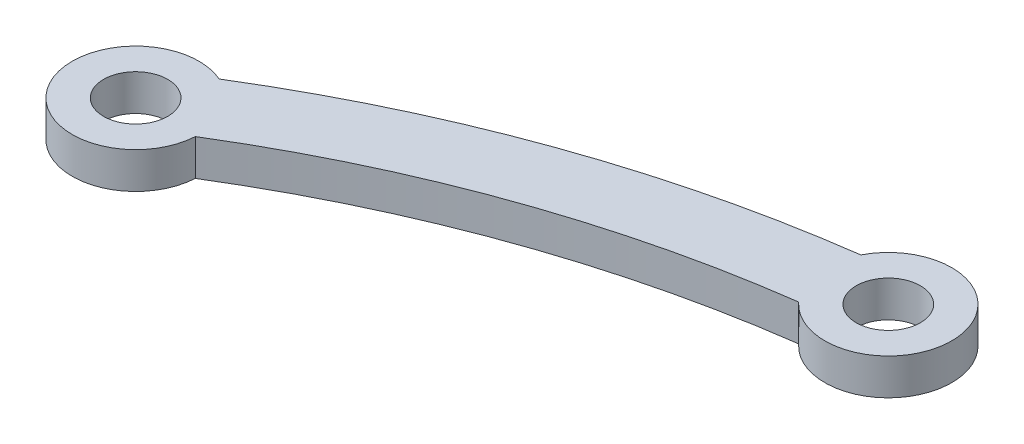
ISO-10303-21;
HEADER;
FILE_DESCRIPTION(('STEP AP214'),'2;1');
FILE_NAME('part.step','',(''),(''),'','','');
FILE_SCHEMA(('AUTOMOTIVE_DESIGN { 1 0 10303 214 1 1 1 1 }'));
ENDSEC;
DATA;
#1=APPLICATION_CONTEXT('core data for automotive mechanical design processes');
#2=APPLICATION_PROTOCOL_DEFINITION('international standard','automotive_design',2000,#1);
#3=PRODUCT_CONTEXT('',#1,'mechanical');
#4=PRODUCT('Part','Part','',(#3));
#5=PRODUCT_RELATED_PRODUCT_CATEGORY('part','',(#4));
#6=PRODUCT_DEFINITION_FORMATION('','',#4);
#7=PRODUCT_DEFINITION_CONTEXT('part definition',#1,'design');
#8=PRODUCT_DEFINITION('design','',#6,#7);
#9=PRODUCT_DEFINITION_SHAPE('','',#8);
#10=(LENGTH_UNIT() NAMED_UNIT(*) SI_UNIT(.MILLI.,.METRE.));
#11=(NAMED_UNIT(*) PLANE_ANGLE_UNIT() SI_UNIT($,.RADIAN.));
#12=(NAMED_UNIT(*) SI_UNIT($,.STERADIAN.) SOLID_ANGLE_UNIT());
#13=UNCERTAINTY_MEASURE_WITH_UNIT(LENGTH_MEASURE(1.E-05),#10,'distance_accuracy_value','');
#14=(GEOMETRIC_REPRESENTATION_CONTEXT(3) GLOBAL_UNCERTAINTY_ASSIGNED_CONTEXT((#13)) GLOBAL_UNIT_ASSIGNED_CONTEXT((#10,
#11,#12)) REPRESENTATION_CONTEXT('',''));
#15=CARTESIAN_POINT('',(0.,0.,0.));
#16=DIRECTION('',(0.,0.,1.));
#17=DIRECTION('',(1.,0.,0.));
#18=AXIS2_PLACEMENT_3D('',#15,#16,#17);
#19=CARTESIAN_POINT('',(-47.2140331764881,2.54,-12.7));
#20=DIRECTION('',(0.,-1.,0.));
#21=DIRECTION('',(0.,0.,-1.));
#22=AXIS2_PLACEMENT_3D('',#19,#20,#21);
#23=CYLINDRICAL_SURFACE('',#22,4.445);
#24=CARTESIAN_POINT('',(-47.2140331764881,0.,-12.7));
#25=DIRECTION('',(0.,1.,0.));
#26=DIRECTION('',(0.,0.,1.));
#27=AXIS2_PLACEMENT_3D('',#24,#25,#26);
#28=CIRCLE('',#27,4.445);
#29=CARTESIAN_POINT('',(-45.4322346630016,0.,-16.7722498765839));
#30=VERTEX_POINT('',#29);
#31=CARTESIAN_POINT('',(-42.7765447896225,0.,-12.4416943352668));
#32=VERTEX_POINT('',#31);
#33=EDGE_CURVE('E105',#30,#32,#28,.T.);
#34=ORIENTED_EDGE('',*,*,#33,.T.);
#35=DIRECTION('',(0.,-1.,0.));
#36=VECTOR('',#35,1.);
#37=CARTESIAN_POINT('',(-42.7765447896225,2.54,-12.4416943352668));
#38=LINE('',#37,#36);
#39=CARTESIAN_POINT('',(-42.7765447896225,2.54,-12.4416943352668));
#40=VERTEX_POINT('',#39);
#41=EDGE_CURVE('E11',#40,#32,#38,.T.);
#42=ORIENTED_EDGE('',*,*,#41,.F.);
#43=CARTESIAN_POINT('',(-47.2140331764881,2.54,-12.7));
#44=DIRECTION('',(0.,1.,0.));
#45=DIRECTION('',(0.,0.,1.));
#46=AXIS2_PLACEMENT_3D('',#43,#44,#45);
#47=CIRCLE('',#46,4.445);
#48=CARTESIAN_POINT('',(-45.4322346630016,2.54,-16.7722498765839));
#49=VERTEX_POINT('',#48);
#50=EDGE_CURVE('E85',#49,#40,#47,.T.);
#51=ORIENTED_EDGE('',*,*,#50,.F.);
#52=DIRECTION('',(0.,-1.,0.));
#53=VECTOR('',#52,1.);
#54=CARTESIAN_POINT('',(-45.4322346630016,2.54,-16.7722498765839));
#55=LINE('',#54,#53);
#56=EDGE_CURVE('E52',#49,#30,#55,.T.);
#57=ORIENTED_EDGE('',*,*,#56,.T.);
#58=EDGE_LOOP('',(#34,#42,#51,#57));
#59=FACE_BOUND('',#58,.T.);
#60=ADVANCED_FACE('F35',(#59),#23,.T.);
#61=CARTESIAN_POINT('',(-0.90631721743742,2.54,55.8348570220722));
#62=DIRECTION('',(0.,-1.,0.));
#63=DIRECTION('',(0.,0.,-1.));
#64=AXIS2_PLACEMENT_3D('',#61,#62,#63);
#65=CYLINDRICAL_SURFACE('',#64,80.0924679492268);
#66=CARTESIAN_POINT('',(-0.90631721743742,0.,55.8348570220722));
#67=DIRECTION('',(0.,1.,0.));
#68=DIRECTION('',(0.,0.,1.));
#69=AXIS2_PLACEMENT_3D('',#66,#67,#68);
#70=CIRCLE('',#69,80.0924679492268);
#71=CARTESIAN_POINT('',(-11.6058593185938,0.,-23.5397183848143));
#72=VERTEX_POINT('',#71);
#73=EDGE_CURVE('E90',#32,#72,#70,.F.);
#74=ORIENTED_EDGE('',*,*,#73,.T.);
#75=DIRECTION('',(0.,-1.,0.));
#76=VECTOR('',#75,1.);
#77=CARTESIAN_POINT('',(-11.6058593185938,2.54,-23.5397183848143));
#78=LINE('',#77,#76);
#79=CARTESIAN_POINT('',(-11.6058593185938,2.54,-23.5397183848143));
#80=VERTEX_POINT('',#79);
#81=EDGE_CURVE('E44',#80,#72,#78,.T.);
#82=ORIENTED_EDGE('',*,*,#81,.F.);
#83=CARTESIAN_POINT('',(-0.90631721743742,2.54,55.8348570220722));
#84=DIRECTION('',(0.,1.,0.));
#85=DIRECTION('',(0.,0.,1.));
#86=AXIS2_PLACEMENT_3D('',#83,#84,#85);
#87=CIRCLE('',#86,80.0924679492268);
#88=EDGE_CURVE('E78',#40,#80,#87,.F.);
#89=ORIENTED_EDGE('',*,*,#88,.F.);
#90=ORIENTED_EDGE('',*,*,#41,.T.);
#91=EDGE_LOOP('',(#74,#82,#89,#90));
#92=FACE_BOUND('',#91,.T.);
#93=ADVANCED_FACE('F89',(#92),#65,.F.);
#94=CARTESIAN_POINT('',(-8.33007658776869,2.54,-26.5442603632908));
#95=DIRECTION('',(0.,-1.,0.));
#96=DIRECTION('',(0.,0.,-1.));
#97=AXIS2_PLACEMENT_3D('',#94,#95,#96);
#98=CYLINDRICAL_SURFACE('',#97,4.44500000000001);
#99=CARTESIAN_POINT('',(-8.33007658776869,0.,-26.5442603632908));
#100=DIRECTION('',(0.,1.,0.));
#101=DIRECTION('',(0.,0.,1.));
#102=AXIS2_PLACEMENT_3D('',#99,#100,#101);
#103=CIRCLE('',#102,4.44500000000001);
#104=CARTESIAN_POINT('',(-12.2844958404242,0.,-28.5741848382965));
#105=VERTEX_POINT('',#104);
#106=EDGE_CURVE('E108',#72,#105,#103,.T.);
#107=ORIENTED_EDGE('',*,*,#106,.T.);
#108=DIRECTION('',(0.,-1.,0.));
#109=VECTOR('',#108,1.);
#110=CARTESIAN_POINT('',(-12.2844958404242,2.54,-28.5741848382965));
#111=LINE('',#110,#109);
#112=CARTESIAN_POINT('',(-12.2844958404242,2.54,-28.5741848382965));
#113=VERTEX_POINT('',#112);
#114=EDGE_CURVE('E67',#113,#105,#111,.T.);
#115=ORIENTED_EDGE('',*,*,#114,.F.);
#116=CARTESIAN_POINT('',(-8.33007658776869,2.54,-26.5442603632908));
#117=DIRECTION('',(0.,1.,0.));
#118=DIRECTION('',(0.,0.,1.));
#119=AXIS2_PLACEMENT_3D('',#116,#117,#118);
#120=CIRCLE('',#119,4.44500000000001);
#121=EDGE_CURVE('E84',#80,#113,#120,.T.);
#122=ORIENTED_EDGE('',*,*,#121,.F.);
#123=ORIENTED_EDGE('',*,*,#81,.T.);
#124=EDGE_LOOP('',(#107,#115,#122,#123));
#125=FACE_BOUND('',#124,.T.);
#126=ADVANCED_FACE('F93',(#125),#98,.T.);
#127=CARTESIAN_POINT('',(-8.33007658776869,2.54,-26.5442603632908));
#128=DIRECTION('',(0.,-1.,0.));
#129=DIRECTION('',(0.,0.,-1.));
#130=AXIS2_PLACEMENT_3D('',#127,#128,#129);
#131=CYLINDRICAL_SURFACE('',#130,2.2479);
#132=CARTESIAN_POINT('',(-8.33007658776869,2.54,-26.5442603632908));
#133=DIRECTION('',(0.,1.,0.));
#134=DIRECTION('',(0.,0.,1.));
#135=AXIS2_PLACEMENT_3D('',#132,#133,#134);
#136=CIRCLE('',#135,2.2479);
#137=CARTESIAN_POINT('',(-8.33007658776869,2.54,-24.2963603632908));
#138=VERTEX_POINT('',#137);
#139=EDGE_CURVE('E117',#138,#138,#136,.T.);
#140=ORIENTED_EDGE('',*,*,#139,.T.);
#141=EDGE_LOOP('',(#140));
#142=FACE_BOUND('',#141,.T.);
#143=CARTESIAN_POINT('',(-8.33007658776869,0.,-26.5442603632908));
#144=DIRECTION('',(0.,1.,0.));
#145=DIRECTION('',(0.,0.,1.));
#146=AXIS2_PLACEMENT_3D('',#143,#144,#145);
#147=CIRCLE('',#146,2.2479);
#148=CARTESIAN_POINT('',(-8.33007658776869,0.,-24.2963603632908));
#149=VERTEX_POINT('',#148);
#150=EDGE_CURVE('E102',#149,#149,#147,.T.);
#151=ORIENTED_EDGE('',*,*,#150,.F.);
#152=EDGE_LOOP('',(#151));
#153=FACE_BOUND('',#152,.T.);
#154=ADVANCED_FACE('F125',(#142,#153),#131,.F.);
#155=CARTESIAN_POINT('',(-47.2140331764881,2.54,-12.7));
#156=DIRECTION('',(0.,-1.,0.));
#157=DIRECTION('',(0.,0.,-1.));
#158=AXIS2_PLACEMENT_3D('',#155,#156,#157);
#159=CYLINDRICAL_SURFACE('',#158,2.2479);
#160=CARTESIAN_POINT('',(-47.2140331764881,2.54,-12.7));
#161=DIRECTION('',(0.,1.,0.));
#162=DIRECTION('',(0.,0.,1.));
#163=AXIS2_PLACEMENT_3D('',#160,#161,#162);
#164=CIRCLE('',#163,2.2479);
#165=CARTESIAN_POINT('',(-47.2140331764881,2.54,-10.4521));
#166=VERTEX_POINT('',#165);
#167=EDGE_CURVE('E113',#166,#166,#164,.T.);
#168=ORIENTED_EDGE('',*,*,#167,.T.);
#169=EDGE_LOOP('',(#168));
#170=FACE_BOUND('',#169,.T.);
#171=CARTESIAN_POINT('',(-47.2140331764881,0.,-12.7));
#172=DIRECTION('',(0.,1.,0.));
#173=DIRECTION('',(0.,0.,1.));
#174=AXIS2_PLACEMENT_3D('',#171,#172,#173);
#175=CIRCLE('',#174,2.2479);
#176=CARTESIAN_POINT('',(-47.2140331764881,0.,-10.4521));
#177=VERTEX_POINT('',#176);
#178=EDGE_CURVE('E99',#177,#177,#175,.T.);
#179=ORIENTED_EDGE('',*,*,#178,.F.);
#180=EDGE_LOOP('',(#179));
#181=FACE_BOUND('',#180,.T.);
#182=ADVANCED_FACE('F37',(#170,#181),#159,.F.);
#183=CARTESIAN_POINT('',(-0.90631721743742,2.54,55.8348570220722));
#184=DIRECTION('',(0.,-1.,0.));
#185=DIRECTION('',(0.,0.,-1.));
#186=AXIS2_PLACEMENT_3D('',#183,#184,#185);
#187=CYLINDRICAL_SURFACE('',#186,85.1724679492268);
#188=CARTESIAN_POINT('',(-0.90631721743742,0.,55.8348570220722));
#189=DIRECTION('',(0.,1.,0.));
#190=DIRECTION('',(0.,0.,1.));
#191=AXIS2_PLACEMENT_3D('',#188,#189,#190);
#192=CIRCLE('',#191,85.1724679492268);
#193=EDGE_CURVE('E110',#30,#105,#192,.F.);
#194=ORIENTED_EDGE('',*,*,#193,.F.);
#195=ORIENTED_EDGE('',*,*,#56,.F.);
#196=CARTESIAN_POINT('',(-0.90631721743742,2.54,55.8348570220722));
#197=DIRECTION('',(0.,1.,0.));
#198=DIRECTION('',(0.,0.,1.));
#199=AXIS2_PLACEMENT_3D('',#196,#197,#198);
#200=CIRCLE('',#199,85.1724679492268);
#201=EDGE_CURVE('E94',#49,#113,#200,.F.);
#202=ORIENTED_EDGE('',*,*,#201,.T.);
#203=ORIENTED_EDGE('',*,*,#114,.T.);
#204=EDGE_LOOP('',(#194,#195,#202,#203));
#205=FACE_BOUND('',#204,.T.);
#206=ADVANCED_FACE('F130',(#205),#187,.T.);
#207=CARTESIAN_POINT('',(0.,2.54,0.));
#208=DIRECTION('',(0.,1.,0.));
#209=DIRECTION('',(0.,0.,1.));
#210=AXIS2_PLACEMENT_3D('',#207,#208,#209);
#211=PLANE('',#210);
#212=ORIENTED_EDGE('',*,*,#167,.F.);
#213=EDGE_LOOP('',(#212));
#214=FACE_BOUND('',#213,.T.);
#215=ORIENTED_EDGE('',*,*,#139,.F.);
#216=EDGE_LOOP('',(#215));
#217=FACE_BOUND('',#216,.T.);
#218=ORIENTED_EDGE('',*,*,#50,.T.);
#219=ORIENTED_EDGE('',*,*,#88,.T.);
#220=ORIENTED_EDGE('',*,*,#121,.T.);
#221=ORIENTED_EDGE('',*,*,#201,.F.);
#222=EDGE_LOOP('',(#218,#219,#220,#221));
#223=FACE_BOUND('',#222,.T.);
#224=ADVANCED_FACE('F81',(#214,#217,#223),#211,.T.);
#225=CARTESIAN_POINT('',(0.,0.,0.));
#226=DIRECTION('',(0.,1.,0.));
#227=DIRECTION('',(0.,0.,1.));
#228=AXIS2_PLACEMENT_3D('',#225,#226,#227);
#229=PLANE('',#228);
#230=ORIENTED_EDGE('',*,*,#178,.T.);
#231=EDGE_LOOP('',(#230));
#232=FACE_BOUND('',#231,.T.);
#233=ORIENTED_EDGE('',*,*,#150,.T.);
#234=EDGE_LOOP('',(#233));
#235=FACE_BOUND('',#234,.T.);
#236=ORIENTED_EDGE('',*,*,#33,.F.);
#237=ORIENTED_EDGE('',*,*,#193,.T.);
#238=ORIENTED_EDGE('',*,*,#106,.F.);
#239=ORIENTED_EDGE('',*,*,#73,.F.);
#240=EDGE_LOOP('',(#236,#237,#238,#239));
#241=FACE_BOUND('',#240,.T.);
#242=ADVANCED_FACE('F129',(#232,#235,#241),#229,.F.);
#243=CLOSED_SHELL('',(#60,#93,#126,#154,#182,#206,#224,#242));
#244=MANIFOLD_SOLID_BREP('B2',#243);
#245=ADVANCED_BREP_SHAPE_REPRESENTATION('',(#18,#244),#14);
#246=SHAPE_DEFINITION_REPRESENTATION(#9,#245);
ENDSEC;
END-ISO-10303-21;
